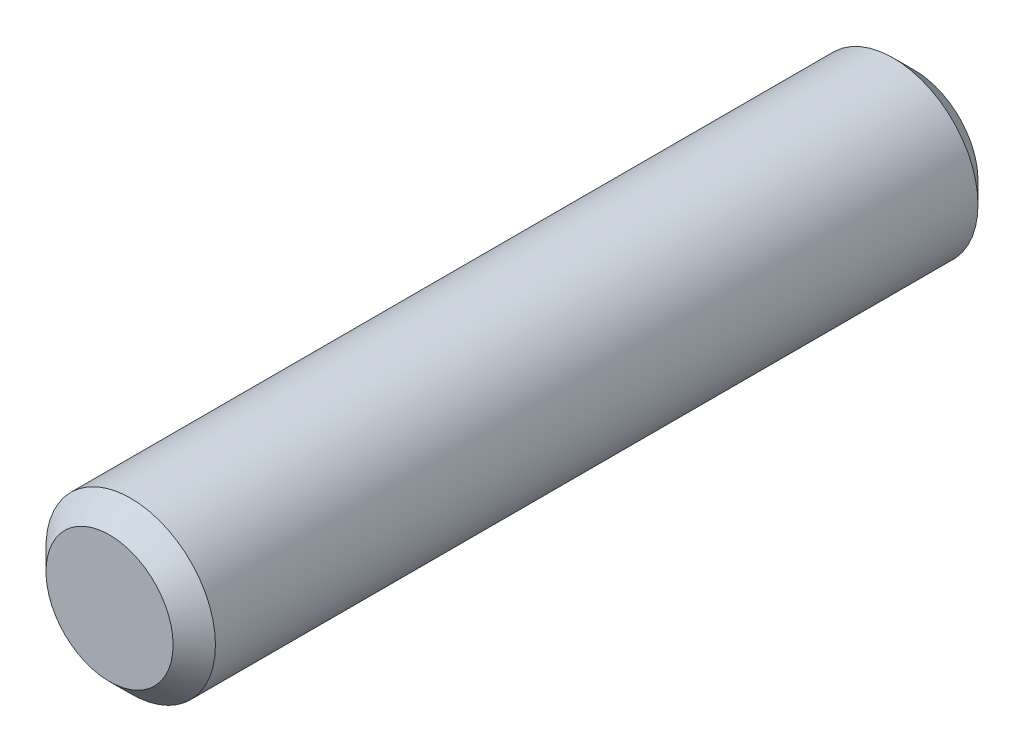
ISO-10303-21;
HEADER;
FILE_DESCRIPTION(('STEP AP214'),'2;1');
FILE_NAME('part.step','',(''),(''),'','','');
FILE_SCHEMA(('AUTOMOTIVE_DESIGN { 1 0 10303 214 1 1 1 1 }'));
ENDSEC;
DATA;
#1=APPLICATION_CONTEXT('core data for automotive mechanical design processes');
#2=APPLICATION_PROTOCOL_DEFINITION('international standard','automotive_design',2000,#1);
#3=PRODUCT_CONTEXT('',#1,'mechanical');
#4=PRODUCT('Part','Part','',(#3));
#5=PRODUCT_RELATED_PRODUCT_CATEGORY('part','',(#4));
#6=PRODUCT_DEFINITION_FORMATION('','',#4);
#7=PRODUCT_DEFINITION_CONTEXT('part definition',#1,'design');
#8=PRODUCT_DEFINITION('design','',#6,#7);
#9=PRODUCT_DEFINITION_SHAPE('','',#8);
#10=(LENGTH_UNIT() NAMED_UNIT(*) SI_UNIT(.MILLI.,.METRE.));
#11=(NAMED_UNIT(*) PLANE_ANGLE_UNIT() SI_UNIT($,.RADIAN.));
#12=(NAMED_UNIT(*) SI_UNIT($,.STERADIAN.) SOLID_ANGLE_UNIT());
#13=UNCERTAINTY_MEASURE_WITH_UNIT(LENGTH_MEASURE(1.E-05),#10,'distance_accuracy_value','');
#14=(GEOMETRIC_REPRESENTATION_CONTEXT(3) GLOBAL_UNCERTAINTY_ASSIGNED_CONTEXT((#13)) GLOBAL_UNIT_ASSIGNED_CONTEXT((#10,
#11,#12)) REPRESENTATION_CONTEXT('',''));
#15=CARTESIAN_POINT('',(0.,0.,0.));
#16=DIRECTION('',(0.,0.,1.));
#17=DIRECTION('',(1.,0.,0.));
#18=AXIS2_PLACEMENT_3D('',#15,#16,#17);
#19=CARTESIAN_POINT('',(0.,0.,38.));
#20=DIRECTION('',(0.,0.,-1.));
#21=DIRECTION('',(-1.,0.,0.));
#22=AXIS2_PLACEMENT_3D('',#19,#20,#21);
#23=CYLINDRICAL_SURFACE('',#22,4.);
#24=CARTESIAN_POINT('',(0.,0.,1.00000000000001));
#25=DIRECTION('',(0.,0.,1.));
#26=DIRECTION('',(1.,0.,0.));
#27=AXIS2_PLACEMENT_3D('',#24,#25,#26);
#28=CIRCLE('',#27,4.);
#29=CARTESIAN_POINT('',(4.,0.,1.00000000000001));
#30=VERTEX_POINT('',#29);
#31=EDGE_CURVE('E42',#30,#30,#28,.T.);
#32=ORIENTED_EDGE('',*,*,#31,.T.);
#33=EDGE_LOOP('',(#32));
#34=FACE_BOUND('',#33,.T.);
#35=CARTESIAN_POINT('',(0.,0.,37.));
#36=DIRECTION('',(0.,0.,1.));
#37=DIRECTION('',(1.,0.,0.));
#38=AXIS2_PLACEMENT_3D('',#35,#36,#37);
#39=CIRCLE('',#38,4.);
#40=CARTESIAN_POINT('',(4.,0.,37.));
#41=VERTEX_POINT('',#40);
#42=EDGE_CURVE('E46',#41,#41,#39,.F.);
#43=ORIENTED_EDGE('',*,*,#42,.T.);
#44=EDGE_LOOP('',(#43));
#45=FACE_BOUND('',#44,.T.);
#46=ADVANCED_FACE('F31',(#34,#45),#23,.T.);
#47=CARTESIAN_POINT('',(0.,0.,38.));
#48=DIRECTION('',(0.,0.,1.));
#49=DIRECTION('',(1.,0.,0.));
#50=AXIS2_PLACEMENT_3D('',#47,#48,#49);
#51=PLANE('',#50);
#52=CARTESIAN_POINT('',(0.,0.,38.));
#53=DIRECTION('',(0.,0.,1.));
#54=DIRECTION('',(1.,0.,0.));
#55=AXIS2_PLACEMENT_3D('',#52,#53,#54);
#56=CIRCLE('',#55,3.);
#57=CARTESIAN_POINT('',(3.,0.,38.));
#58=VERTEX_POINT('',#57);
#59=EDGE_CURVE('E10',#58,#58,#56,.T.);
#60=ORIENTED_EDGE('',*,*,#59,.T.);
#61=EDGE_LOOP('',(#60));
#62=FACE_BOUND('',#61,.T.);
#63=ADVANCED_FACE('F62',(#62),#51,.T.);
#64=CARTESIAN_POINT('',(0.,0.,0.));
#65=DIRECTION('',(0.,0.,1.));
#66=DIRECTION('',(1.,0.,0.));
#67=AXIS2_PLACEMENT_3D('',#64,#65,#66);
#68=PLANE('',#67);
#69=CARTESIAN_POINT('',(0.,0.,0.));
#70=DIRECTION('',(0.,0.,1.));
#71=DIRECTION('',(1.,0.,0.));
#72=AXIS2_PLACEMENT_3D('',#69,#70,#71);
#73=CIRCLE('',#72,2.99999999999999);
#74=CARTESIAN_POINT('',(2.99999999999999,0.,0.));
#75=VERTEX_POINT('',#74);
#76=EDGE_CURVE('E38',#75,#75,#73,.F.);
#77=ORIENTED_EDGE('',*,*,#76,.T.);
#78=EDGE_LOOP('',(#77));
#79=FACE_BOUND('',#78,.T.);
#80=ADVANCED_FACE('F59',(#79),#68,.F.);
#81=CARTESIAN_POINT('',(0.,0.,1.00000000000001));
#82=DIRECTION('',(0.,0.,1.));
#83=DIRECTION('',(1.,0.,0.));
#84=AXIS2_PLACEMENT_3D('',#81,#82,#83);
#85=CONICAL_SURFACE('',#84,4.,0.785398163397452);
#86=ORIENTED_EDGE('',*,*,#76,.F.);
#87=EDGE_LOOP('',(#86));
#88=FACE_BOUND('',#87,.T.);
#89=ORIENTED_EDGE('',*,*,#31,.F.);
#90=EDGE_LOOP('',(#89));
#91=FACE_BOUND('',#90,.T.);
#92=ADVANCED_FACE('F55',(#88,#91),#85,.T.);
#93=CARTESIAN_POINT('',(0.,0.,38.));
#94=DIRECTION('',(0.,0.,-1.));
#95=DIRECTION('',(-1.,0.,0.));
#96=AXIS2_PLACEMENT_3D('',#93,#94,#95);
#97=CONICAL_SURFACE('',#96,3.,0.785398163397441);
#98=ORIENTED_EDGE('',*,*,#42,.F.);
#99=EDGE_LOOP('',(#98));
#100=FACE_BOUND('',#99,.T.);
#101=ORIENTED_EDGE('',*,*,#59,.F.);
#102=EDGE_LOOP('',(#101));
#103=FACE_BOUND('',#102,.T.);
#104=ADVANCED_FACE('F33',(#100,#103),#97,.T.);
#105=CLOSED_SHELL('',(#46,#63,#80,#92,#104));
#106=MANIFOLD_SOLID_BREP('B2',#105);
#107=ADVANCED_BREP_SHAPE_REPRESENTATION('',(#18,#106),#14);
#108=SHAPE_DEFINITION_REPRESENTATION(#9,#107);
ENDSEC;
END-ISO-10303-21;
